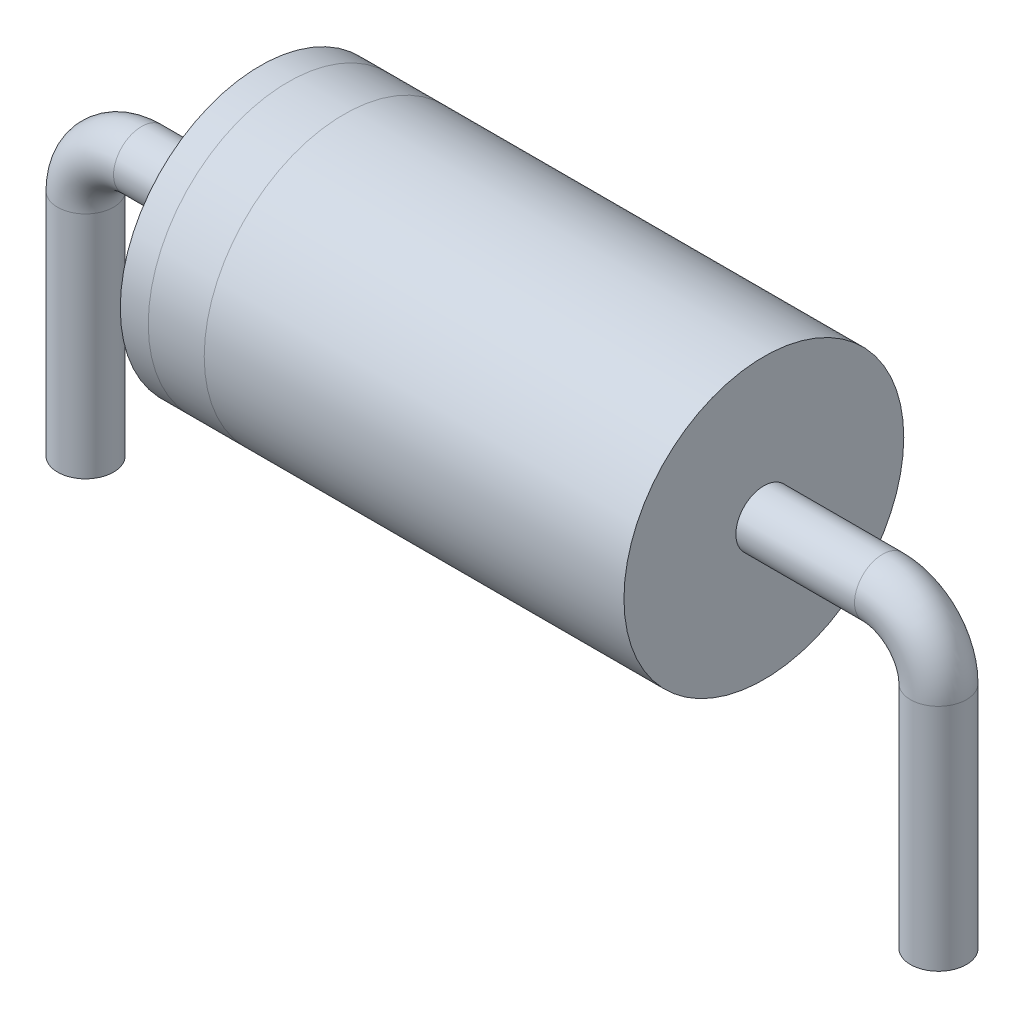
ISO-10303-21;
HEADER;
FILE_DESCRIPTION(('STEP AP214'),'2;1');
FILE_NAME('part.step','',(''),(''),'','','');
FILE_SCHEMA(('AUTOMOTIVE_DESIGN { 1 0 10303 214 1 1 1 1 }'));
ENDSEC;
DATA;
#1=APPLICATION_CONTEXT('core data for automotive mechanical design processes');
#2=APPLICATION_PROTOCOL_DEFINITION('international standard','automotive_design',2000,#1);
#3=PRODUCT_CONTEXT('',#1,'mechanical');
#4=PRODUCT('Part','Part','',(#3));
#5=PRODUCT_RELATED_PRODUCT_CATEGORY('part','',(#4));
#6=PRODUCT_DEFINITION_FORMATION('','',#4);
#7=PRODUCT_DEFINITION_CONTEXT('part definition',#1,'design');
#8=PRODUCT_DEFINITION('design','',#6,#7);
#9=PRODUCT_DEFINITION_SHAPE('','',#8);
#10=(LENGTH_UNIT() NAMED_UNIT(*) SI_UNIT(.MILLI.,.METRE.));
#11=(NAMED_UNIT(*) PLANE_ANGLE_UNIT() SI_UNIT($,.RADIAN.));
#12=(NAMED_UNIT(*) SI_UNIT($,.STERADIAN.) SOLID_ANGLE_UNIT());
#13=UNCERTAINTY_MEASURE_WITH_UNIT(LENGTH_MEASURE(1.E-05),#10,'distance_accuracy_value','');
#14=(GEOMETRIC_REPRESENTATION_CONTEXT(3) GLOBAL_UNCERTAINTY_ASSIGNED_CONTEXT((#13)) GLOBAL_UNIT_ASSIGNED_CONTEXT((#10,
#11,#12)) REPRESENTATION_CONTEXT('',''));
#15=CARTESIAN_POINT('',(0.,0.,0.));
#16=DIRECTION('',(0.,0.,1.));
#17=DIRECTION('',(1.,0.,0.));
#18=AXIS2_PLACEMENT_3D('',#15,#16,#17);
#19=CARTESIAN_POINT('',(-4.5,0.,0.));
#20=DIRECTION('',(1.,0.,0.));
#21=DIRECTION('',(0.,0.,-1.));
#22=AXIS2_PLACEMENT_3D('',#19,#20,#21);
#23=CYLINDRICAL_SURFACE('',#22,2.5);
#24=CARTESIAN_POINT('',(-3.,0.,0.));
#25=DIRECTION('',(1.,0.,0.));
#26=DIRECTION('',(0.,0.,-1.));
#27=AXIS2_PLACEMENT_3D('',#24,#25,#26);
#28=CIRCLE('',#27,2.5);
#29=CARTESIAN_POINT('',(-3.,0.,-2.5));
#30=VERTEX_POINT('',#29);
#31=EDGE_CURVE('E76',#30,#30,#28,.T.);
#32=ORIENTED_EDGE('',*,*,#31,.F.);
#33=EDGE_LOOP('',(#32));
#34=FACE_BOUND('',#33,.T.);
#35=CARTESIAN_POINT('',(-4.,0.,0.));
#36=DIRECTION('',(1.,0.,0.));
#37=DIRECTION('',(0.,0.,-1.));
#38=AXIS2_PLACEMENT_3D('',#35,#36,#37);
#39=CIRCLE('',#38,2.5);
#40=CARTESIAN_POINT('',(-4.,0.,-2.5));
#41=VERTEX_POINT('',#40);
#42=EDGE_CURVE('E13',#41,#41,#39,.T.);
#43=ORIENTED_EDGE('',*,*,#42,.T.);
#44=EDGE_LOOP('',(#43));
#45=FACE_BOUND('',#44,.T.);
#46=ADVANCED_FACE('F64',(#34,#45),#23,.T.);
#47=CARTESIAN_POINT('',(4.5,0.,0.));
#48=DIRECTION('',(1.,0.,0.));
#49=DIRECTION('',(0.,0.,-1.));
#50=AXIS2_PLACEMENT_3D('',#47,#48,#49);
#51=CIRCLE('',#50,2.5);
#52=CARTESIAN_POINT('',(4.5,0.,-2.5));
#53=VERTEX_POINT('',#52);
#54=EDGE_CURVE('E93',#53,#53,#51,.T.);
#55=ORIENTED_EDGE('',*,*,#54,.F.);
#56=EDGE_LOOP('',(#55));
#57=FACE_BOUND('',#56,.T.);
#58=ORIENTED_EDGE('',*,*,#31,.T.);
#59=EDGE_LOOP('',(#58));
#60=FACE_BOUND('',#59,.T.);
#61=ADVANCED_FACE('F144',(#57,#60),#23,.T.);
#62=ORIENTED_EDGE('',*,*,#42,.F.);
#63=EDGE_LOOP('',(#62));
#64=FACE_BOUND('',#63,.T.);
#65=CARTESIAN_POINT('',(-4.5,0.,0.));
#66=DIRECTION('',(1.,0.,0.));
#67=DIRECTION('',(0.,0.,-1.));
#68=AXIS2_PLACEMENT_3D('',#65,#66,#67);
#69=CIRCLE('',#68,2.5);
#70=CARTESIAN_POINT('',(-4.5,0.,-2.5));
#71=VERTEX_POINT('',#70);
#72=EDGE_CURVE('E103',#71,#71,#69,.T.);
#73=ORIENTED_EDGE('',*,*,#72,.T.);
#74=EDGE_LOOP('',(#73));
#75=FACE_BOUND('',#74,.T.);
#76=ADVANCED_FACE('F66',(#64,#75),#23,.T.);
#77=CARTESIAN_POINT('',(-4.5,0.,0.));
#78=DIRECTION('',(1.,0.,0.));
#79=DIRECTION('',(0.,0.,-1.));
#80=AXIS2_PLACEMENT_3D('',#77,#78,#79);
#81=PLANE('',#80);
#82=CARTESIAN_POINT('',(-4.5,0.,0.));
#83=DIRECTION('',(1.,0.,0.));
#84=DIRECTION('',(0.,0.,-1.));
#85=AXIS2_PLACEMENT_3D('',#82,#83,#84);
#86=CIRCLE('',#85,0.5);
#87=CARTESIAN_POINT('',(-4.5,0.,-0.5));
#88=VERTEX_POINT('',#87);
#89=EDGE_CURVE('E100',#88,#88,#86,.F.);
#90=ORIENTED_EDGE('',*,*,#89,.F.);
#91=EDGE_LOOP('',(#90));
#92=FACE_BOUND('',#91,.T.);
#93=ORIENTED_EDGE('',*,*,#72,.F.);
#94=EDGE_LOOP('',(#93));
#95=FACE_BOUND('',#94,.T.);
#96=ADVANCED_FACE('F143',(#92,#95),#81,.F.);
#97=CARTESIAN_POINT('',(4.5,0.,0.));
#98=DIRECTION('',(1.,0.,0.));
#99=DIRECTION('',(0.,0.,-1.));
#100=AXIS2_PLACEMENT_3D('',#97,#98,#99);
#101=PLANE('',#100);
#102=CARTESIAN_POINT('',(4.5,0.,0.));
#103=DIRECTION('',(1.,0.,0.));
#104=DIRECTION('',(0.,0.,-1.));
#105=AXIS2_PLACEMENT_3D('',#102,#103,#104);
#106=CIRCLE('',#105,0.5);
#107=CARTESIAN_POINT('',(4.5,0.,-0.5));
#108=VERTEX_POINT('',#107);
#109=EDGE_CURVE('E89',#108,#108,#106,.F.);
#110=ORIENTED_EDGE('',*,*,#109,.T.);
#111=EDGE_LOOP('',(#110));
#112=FACE_BOUND('',#111,.T.);
#113=ORIENTED_EDGE('',*,*,#54,.T.);
#114=EDGE_LOOP('',(#113));
#115=FACE_BOUND('',#114,.T.);
#116=ADVANCED_FACE('F148',(#112,#115),#101,.T.);
#117=CARTESIAN_POINT('',(7.62,-5.1,0.));
#118=DIRECTION('',(0.,-1.,0.));
#119=DIRECTION('',(0.,0.,-1.));
#120=AXIS2_PLACEMENT_3D('',#117,#118,#119);
#121=PLANE('',#120);
#122=CARTESIAN_POINT('',(7.62,-5.1,0.));
#123=DIRECTION('',(0.,-1.,0.));
#124=DIRECTION('',(0.,0.,-1.));
#125=AXIS2_PLACEMENT_3D('',#122,#123,#124);
#126=CIRCLE('',#125,0.5);
#127=CARTESIAN_POINT('',(7.62,-5.1,-0.5));
#128=VERTEX_POINT('',#127);
#129=EDGE_CURVE('E81',#128,#128,#126,.T.);
#130=ORIENTED_EDGE('',*,*,#129,.T.);
#131=EDGE_LOOP('',(#130));
#132=FACE_BOUND('',#131,.T.);
#133=ADVANCED_FACE('F153',(#132),#121,.T.);
#134=CARTESIAN_POINT('',(7.62,-5.1,0.));
#135=DIRECTION('',(0.,1.,0.));
#136=DIRECTION('',(0.,0.,1.));
#137=AXIS2_PLACEMENT_3D('',#134,#135,#136);
#138=CYLINDRICAL_SURFACE('',#137,0.5);
#139=CARTESIAN_POINT('',(7.62,-1.,0.));
#140=DIRECTION('',(0.,-1.,0.));
#141=DIRECTION('',(0.,0.,-1.));
#142=AXIS2_PLACEMENT_3D('',#139,#140,#141);
#143=CIRCLE('',#142,0.5);
#144=CARTESIAN_POINT('',(8.12,-1.,0.));
#145=VERTEX_POINT('',#144);
#146=EDGE_CURVE('E273',#145,#145,#143,.T.);
#147=ORIENTED_EDGE('',*,*,#146,.T.);
#148=EDGE_LOOP('',(#147));
#149=FACE_BOUND('',#148,.T.);
#150=ORIENTED_EDGE('',*,*,#129,.F.);
#151=EDGE_LOOP('',(#150));
#152=FACE_BOUND('',#151,.T.);
#153=ADVANCED_FACE('F190',(#149,#152),#138,.T.);
#154=CARTESIAN_POINT('',(6.62,-1.,0.));
#155=DIRECTION('',(0.,0.,1.));
#156=DIRECTION('',(1.,0.,0.));
#157=AXIS2_PLACEMENT_3D('',#154,#155,#156);
#158=TOROIDAL_SURFACE('',#157,1.,0.5);
#159=CARTESIAN_POINT('',(6.62,0.,0.));
#160=DIRECTION('',(1.,0.,0.));
#161=DIRECTION('',(0.,0.,-1.));
#162=AXIS2_PLACEMENT_3D('',#159,#160,#161);
#163=CIRCLE('',#162,0.5);
#164=CARTESIAN_POINT('',(6.62,0.5,0.));
#165=VERTEX_POINT('',#164);
#166=EDGE_CURVE('E271',#165,#165,#163,.T.);
#167=CARTESIAN_POINT('',(6.62,-1.,0.));
#168=DIRECTION('',(0.,0.,1.));
#169=DIRECTION('',(1.,0.,0.));
#170=AXIS2_PLACEMENT_3D('',#167,#168,#169);
#171=CIRCLE('',#170,1.5);
#172=EDGE_CURVE('',#145,#165,#171,.T.);
#173=ORIENTED_EDGE('',*,*,#146,.F.);
#174=ORIENTED_EDGE('',*,*,#166,.T.);
#175=ORIENTED_EDGE('',*,*,#172,.T.);
#176=ORIENTED_EDGE('',*,*,#172,.F.);
#177=EDGE_LOOP('',(#173,#175,#174,#176));
#178=FACE_BOUND('',#177,.T.);
#179=ADVANCED_FACE('F199',(#178),#158,.T.);
#180=CARTESIAN_POINT('',(6.62,0.,0.));
#181=DIRECTION('',(-1.,0.,0.));
#182=DIRECTION('',(0.,0.,1.));
#183=AXIS2_PLACEMENT_3D('',#180,#181,#182);
#184=CYLINDRICAL_SURFACE('',#183,0.5);
#185=ORIENTED_EDGE('',*,*,#109,.F.);
#186=EDGE_LOOP('',(#185));
#187=FACE_BOUND('',#186,.T.);
#188=ORIENTED_EDGE('',*,*,#166,.F.);
#189=EDGE_LOOP('',(#188));
#190=FACE_BOUND('',#189,.T.);
#191=ADVANCED_FACE('F208',(#187,#190),#184,.T.);
#192=CARTESIAN_POINT('',(-6.62,0.,0.));
#193=DIRECTION('',(1.,0.,0.));
#194=DIRECTION('',(0.,0.,-1.));
#195=AXIS2_PLACEMENT_3D('',#192,#193,#194);
#196=CIRCLE('',#195,0.5);
#197=CARTESIAN_POINT('',(-6.62,0.5,0.));
#198=VERTEX_POINT('',#197);
#199=EDGE_CURVE('E96',#198,#198,#196,.T.);
#200=ORIENTED_EDGE('',*,*,#199,.T.);
#201=EDGE_LOOP('',(#200));
#202=FACE_BOUND('',#201,.T.);
#203=ORIENTED_EDGE('',*,*,#89,.T.);
#204=EDGE_LOOP('',(#203));
#205=FACE_BOUND('',#204,.T.);
#206=ADVANCED_FACE('F217',(#202,#205),#184,.T.);
#207=CARTESIAN_POINT('',(-7.62,-5.1,0.));
#208=DIRECTION('',(0.,1.,0.));
#209=DIRECTION('',(0.,0.,-1.));
#210=AXIS2_PLACEMENT_3D('',#207,#208,#209);
#211=PLANE('',#210);
#212=CARTESIAN_POINT('',(-7.62,-5.1,0.));
#213=DIRECTION('',(0.,1.,0.));
#214=DIRECTION('',(0.,0.,-1.));
#215=AXIS2_PLACEMENT_3D('',#212,#213,#214);
#216=CIRCLE('',#215,0.5);
#217=CARTESIAN_POINT('',(-7.62,-5.1,-0.5));
#218=VERTEX_POINT('',#217);
#219=EDGE_CURVE('E85',#218,#218,#216,.T.);
#220=ORIENTED_EDGE('',*,*,#219,.F.);
#221=EDGE_LOOP('',(#220));
#222=FACE_BOUND('',#221,.T.);
#223=ADVANCED_FACE('F226',(#222),#211,.F.);
#224=CARTESIAN_POINT('',(-6.62,-1.,0.));
#225=DIRECTION('',(0.,0.,1.));
#226=DIRECTION('',(1.,0.,0.));
#227=AXIS2_PLACEMENT_3D('',#224,#225,#226);
#228=TOROIDAL_SURFACE('',#227,1.,0.5);
#229=CARTESIAN_POINT('',(-7.62,-1.,0.));
#230=DIRECTION('',(0.,1.,0.));
#231=DIRECTION('',(0.,0.,-1.));
#232=AXIS2_PLACEMENT_3D('',#229,#230,#231);
#233=CIRCLE('',#232,0.5);
#234=CARTESIAN_POINT('',(-8.12,-1.,0.));
#235=VERTEX_POINT('',#234);
#236=EDGE_CURVE('E90',#235,#235,#233,.T.);
#237=CARTESIAN_POINT('',(-6.62,-1.,0.));
#238=DIRECTION('',(0.,0.,1.));
#239=DIRECTION('',(1.,0.,0.));
#240=AXIS2_PLACEMENT_3D('',#237,#238,#239);
#241=CIRCLE('',#240,1.5);
#242=EDGE_CURVE('',#198,#235,#241,.T.);
#243=ORIENTED_EDGE('',*,*,#199,.F.);
#244=ORIENTED_EDGE('',*,*,#236,.T.);
#245=ORIENTED_EDGE('',*,*,#242,.T.);
#246=ORIENTED_EDGE('',*,*,#242,.F.);
#247=EDGE_LOOP('',(#243,#245,#244,#246));
#248=FACE_BOUND('',#247,.T.);
#249=ADVANCED_FACE('F234',(#248),#228,.T.);
#250=CARTESIAN_POINT('',(-7.62,-1.,0.));
#251=DIRECTION('',(0.,-1.,0.));
#252=DIRECTION('',(0.,0.,-1.));
#253=AXIS2_PLACEMENT_3D('',#250,#251,#252);
#254=CYLINDRICAL_SURFACE('',#253,0.5);
#255=ORIENTED_EDGE('',*,*,#219,.T.);
#256=EDGE_LOOP('',(#255));
#257=FACE_BOUND('',#256,.T.);
#258=ORIENTED_EDGE('',*,*,#236,.F.);
#259=EDGE_LOOP('',(#258));
#260=FACE_BOUND('',#259,.T.);
#261=ADVANCED_FACE('F86',(#257,#260),#254,.T.);
#262=CLOSED_SHELL('',(#46,#61,#76,#96,#116,#133,#153,#179,#191,#206,#223,#249,#261));
#263=MANIFOLD_SOLID_BREP('B2',#262);
#264=ADVANCED_BREP_SHAPE_REPRESENTATION('',(#18,#263),#14);
#265=SHAPE_DEFINITION_REPRESENTATION(#9,#264);
ENDSEC;
END-ISO-10303-21;
